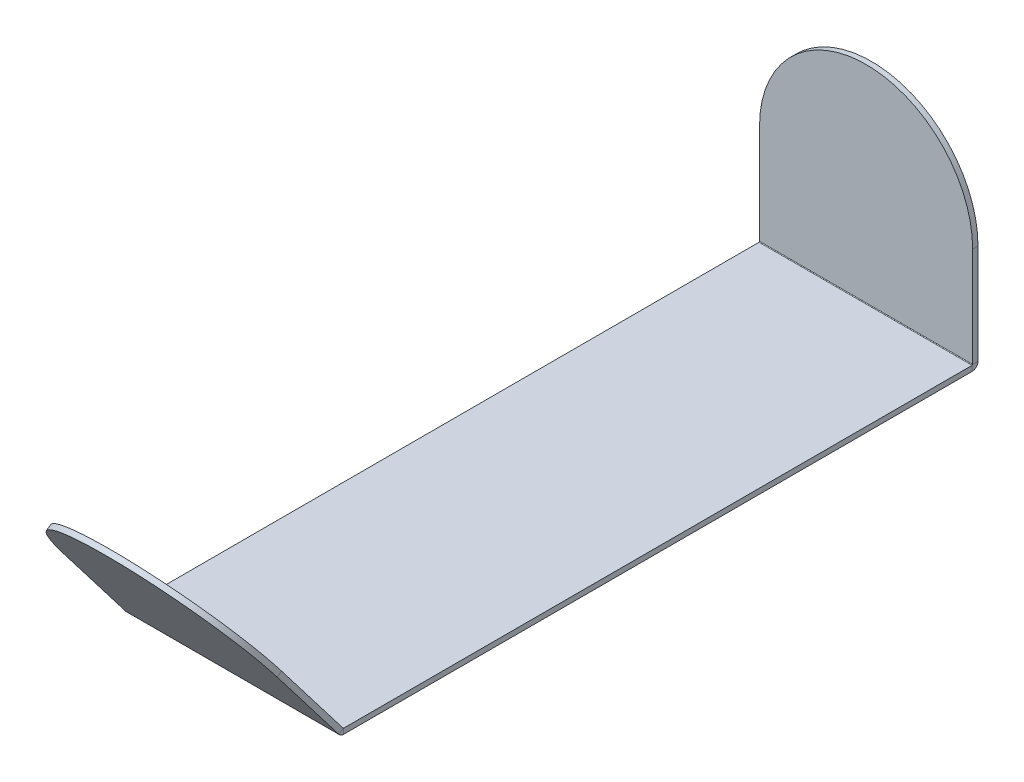
ISO-10303-21;
HEADER;
FILE_DESCRIPTION(('STEP AP214'),'2;1');
FILE_NAME('part.step','',(''),(''),'','','');
FILE_SCHEMA(('AUTOMOTIVE_DESIGN { 1 0 10303 214 1 1 1 1 }'));
ENDSEC;
DATA;
#1=APPLICATION_CONTEXT('core data for automotive mechanical design processes');
#2=APPLICATION_PROTOCOL_DEFINITION('international standard','automotive_design',2000,#1);
#3=PRODUCT_CONTEXT('',#1,'mechanical');
#4=PRODUCT('Part','Part','',(#3));
#5=PRODUCT_RELATED_PRODUCT_CATEGORY('part','',(#4));
#6=PRODUCT_DEFINITION_FORMATION('','',#4);
#7=PRODUCT_DEFINITION_CONTEXT('part definition',#1,'design');
#8=PRODUCT_DEFINITION('design','',#6,#7);
#9=PRODUCT_DEFINITION_SHAPE('','',#8);
#10=(LENGTH_UNIT() NAMED_UNIT(*) SI_UNIT(.MILLI.,.METRE.));
#11=(NAMED_UNIT(*) PLANE_ANGLE_UNIT() SI_UNIT($,.RADIAN.));
#12=(NAMED_UNIT(*) SI_UNIT($,.STERADIAN.) SOLID_ANGLE_UNIT());
#13=UNCERTAINTY_MEASURE_WITH_UNIT(LENGTH_MEASURE(1.E-05),#10,'distance_accuracy_value','');
#14=(GEOMETRIC_REPRESENTATION_CONTEXT(3) GLOBAL_UNCERTAINTY_ASSIGNED_CONTEXT((#13)) GLOBAL_UNIT_ASSIGNED_CONTEXT((#10,
#11,#12)) REPRESENTATION_CONTEXT('',''));
#15=CARTESIAN_POINT('',(0.,0.,0.));
#16=DIRECTION('',(0.,0.,1.));
#17=DIRECTION('',(1.,0.,0.));
#18=AXIS2_PLACEMENT_3D('',#15,#16,#17);
#19=CARTESIAN_POINT('',(-127.,-6.35,473.));
#20=DIRECTION('',(-1.,0.,0.));
#21=DIRECTION('',(0.,0.,1.));
#22=AXIS2_PLACEMENT_3D('',#19,#20,#21);
#23=PLANE('',#22);
#24=DIRECTION('',(0.,0.,1.));
#25=VECTOR('',#24,1.);
#26=CARTESIAN_POINT('',(-127.,-6.35,473.));
#27=LINE('',#26,#25);
#28=CARTESIAN_POINT('',(-127.,-6.35,-399.2634));
#29=VERTEX_POINT('',#28);
#30=CARTESIAN_POINT('',(-127.,-6.35,349.636749079185));
#31=VERTEX_POINT('',#30);
#32=EDGE_CURVE('E285',#29,#31,#27,.T.);
#33=ORIENTED_EDGE('',*,*,#32,.T.);
#34=DIRECTION('',(0.,1.,0.));
#35=VECTOR('',#34,1.);
#36=CARTESIAN_POINT('',(-127.,-6.35000000000001,349.636749079185));
#37=LINE('',#36,#35);
#38=CARTESIAN_POINT('',(-127.,0.,349.636749079185));
#39=VERTEX_POINT('',#38);
#40=EDGE_CURVE('E12',#31,#39,#37,.T.);
#41=ORIENTED_EDGE('',*,*,#40,.T.);
#42=DIRECTION('',(0.,0.,1.));
#43=VECTOR('',#42,1.);
#44=CARTESIAN_POINT('',(-127.,0.,473.));
#45=LINE('',#44,#43);
#46=CARTESIAN_POINT('',(-127.,0.,-399.2634));
#47=VERTEX_POINT('',#46);
#48=EDGE_CURVE('E297',#47,#39,#45,.T.);
#49=ORIENTED_EDGE('',*,*,#48,.F.);
#50=DIRECTION('',(0.,1.,0.));
#51=VECTOR('',#50,1.);
#52=CARTESIAN_POINT('',(-127.,-6.35000000000005,-399.2634));
#53=LINE('',#52,#51);
#54=EDGE_CURVE('E243',#29,#47,#53,.T.);
#55=ORIENTED_EDGE('',*,*,#54,.F.);
#56=EDGE_LOOP('',(#33,#41,#49,#55));
#57=FACE_BOUND('',#56,.T.);
#58=ADVANCED_FACE('F97',(#57),#23,.T.);
#59=CARTESIAN_POINT('',(0.,0.,473.));
#60=DIRECTION('',(0.,1.,0.));
#61=DIRECTION('',(0.,0.,1.));
#62=AXIS2_PLACEMENT_3D('',#59,#60,#61);
#63=PLANE('',#62);
#64=ORIENTED_EDGE('',*,*,#48,.T.);
#65=DIRECTION('',(1.,0.,0.));
#66=VECTOR('',#65,1.);
#67=CARTESIAN_POINT('',(0.,0.,349.636749079185));
#68=LINE('',#67,#66);
#69=CARTESIAN_POINT('',(127.,0.,349.636749079185));
#70=VERTEX_POINT('',#69);
#71=EDGE_CURVE('E105',#39,#70,#68,.T.);
#72=ORIENTED_EDGE('',*,*,#71,.T.);
#73=DIRECTION('',(0.,0.,-1.));
#74=VECTOR('',#73,1.);
#75=CARTESIAN_POINT('',(127.,0.,473.));
#76=LINE('',#75,#74);
#77=CARTESIAN_POINT('',(127.,0.,-399.2634));
#78=VERTEX_POINT('',#77);
#79=EDGE_CURVE('E296',#70,#78,#76,.T.);
#80=ORIENTED_EDGE('',*,*,#79,.T.);
#81=DIRECTION('',(1.,0.,0.));
#82=VECTOR('',#81,1.);
#83=CARTESIAN_POINT('',(0.,0.,-399.2634));
#84=LINE('',#83,#82);
#85=EDGE_CURVE('E254',#47,#78,#84,.T.);
#86=ORIENTED_EDGE('',*,*,#85,.F.);
#87=EDGE_LOOP('',(#64,#72,#80,#86));
#88=FACE_BOUND('',#87,.T.);
#89=ADVANCED_FACE('F350',(#88),#63,.T.);
#90=CARTESIAN_POINT('',(127.,-6.35,473.));
#91=DIRECTION('',(1.,0.,0.));
#92=DIRECTION('',(0.,0.,-1.));
#93=AXIS2_PLACEMENT_3D('',#90,#91,#92);
#94=PLANE('',#93);
#95=ORIENTED_EDGE('',*,*,#79,.F.);
#96=DIRECTION('',(0.,-1.,0.));
#97=VECTOR('',#96,1.);
#98=CARTESIAN_POINT('',(127.,-6.35000000000001,349.636749079185));
#99=LINE('',#98,#97);
#100=CARTESIAN_POINT('',(127.,-6.35,349.636749079185));
#101=VERTEX_POINT('',#100);
#102=EDGE_CURVE('E289',#70,#101,#99,.T.);
#103=ORIENTED_EDGE('',*,*,#102,.T.);
#104=DIRECTION('',(0.,0.,-1.));
#105=VECTOR('',#104,1.);
#106=CARTESIAN_POINT('',(127.,-6.35,473.));
#107=LINE('',#106,#105);
#108=CARTESIAN_POINT('',(127.,-6.35,-399.2634));
#109=VERTEX_POINT('',#108);
#110=EDGE_CURVE('E100',#101,#109,#107,.T.);
#111=ORIENTED_EDGE('',*,*,#110,.T.);
#112=DIRECTION('',(0.,-1.,0.));
#113=VECTOR('',#112,1.);
#114=CARTESIAN_POINT('',(127.,-6.35000000000005,-399.2634));
#115=LINE('',#114,#113);
#116=EDGE_CURVE('E251',#78,#109,#115,.T.);
#117=ORIENTED_EDGE('',*,*,#116,.F.);
#118=EDGE_LOOP('',(#95,#103,#111,#117));
#119=FACE_BOUND('',#118,.T.);
#120=ADVANCED_FACE('F305',(#119),#94,.T.);
#121=CARTESIAN_POINT('',(-127.,-876.27468897737,-406.350000000003));
#122=DIRECTION('',(-1.,0.,0.));
#123=DIRECTION('',(0.,-1.,0.));
#124=AXIS2_PLACEMENT_3D('',#121,#122,#123);
#125=PLANE('',#124);
#126=DIRECTION('',(0.,-1.,0.));
#127=VECTOR('',#126,1.);
#128=CARTESIAN_POINT('',(-127.,-876.27468897737,-406.350000000003));
#129=LINE('',#128,#127);
#130=CARTESIAN_POINT('',(-127.,119.72531102263,-406.35));
#131=VERTEX_POINT('',#130);
#132=CARTESIAN_POINT('',(-127.,0.736600000000032,-406.35));
#133=VERTEX_POINT('',#132);
#134=EDGE_CURVE('E262',#131,#133,#129,.T.);
#135=ORIENTED_EDGE('',*,*,#134,.T.);
#136=DIRECTION('',(0.,0.,1.));
#137=VECTOR('',#136,1.);
#138=CARTESIAN_POINT('',(-127.,0.736600000000032,-406.35));
#139=LINE('',#138,#137);
#140=CARTESIAN_POINT('',(-127.,0.736600000000032,-400.));
#141=VERTEX_POINT('',#140);
#142=EDGE_CURVE('E279',#133,#141,#139,.T.);
#143=ORIENTED_EDGE('',*,*,#142,.T.);
#144=DIRECTION('',(0.,-1.,0.));
#145=VECTOR('',#144,1.);
#146=CARTESIAN_POINT('',(-127.,-876.27468897737,-400.000000000003));
#147=LINE('',#146,#145);
#148=CARTESIAN_POINT('',(-127.,119.72531102263,-400.));
#149=VERTEX_POINT('',#148);
#150=EDGE_CURVE('E121',#149,#141,#147,.T.);
#151=ORIENTED_EDGE('',*,*,#150,.F.);
#152=DIRECTION('',(0.,0.,1.));
#153=VECTOR('',#152,1.);
#154=CARTESIAN_POINT('',(-127.,119.72531102263,-406.35));
#155=LINE('',#154,#153);
#156=EDGE_CURVE('E267',#131,#149,#155,.T.);
#157=ORIENTED_EDGE('',*,*,#156,.F.);
#158=EDGE_LOOP('',(#135,#143,#151,#157));
#159=FACE_BOUND('',#158,.T.);
#160=ADVANCED_FACE('F326',(#159),#125,.T.);
#161=CARTESIAN_POINT('',(127.,-876.27468897737,-406.350000000003));
#162=DIRECTION('',(1.,0.,0.));
#163=DIRECTION('',(0.,1.,0.));
#164=AXIS2_PLACEMENT_3D('',#161,#162,#163);
#165=PLANE('',#164);
#166=DIRECTION('',(0.,1.,0.));
#167=VECTOR('',#166,1.);
#168=CARTESIAN_POINT('',(127.,-876.27468897737,-400.000000000003));
#169=LINE('',#168,#167);
#170=CARTESIAN_POINT('',(127.,0.736600000000032,-400.));
#171=VERTEX_POINT('',#170);
#172=CARTESIAN_POINT('',(127.,119.72531102263,-400.));
#173=VERTEX_POINT('',#172);
#174=EDGE_CURVE('E266',#171,#173,#169,.T.);
#175=ORIENTED_EDGE('',*,*,#174,.F.);
#176=DIRECTION('',(0.,0.,-1.));
#177=VECTOR('',#176,1.);
#178=CARTESIAN_POINT('',(127.,0.736600000000032,-406.35));
#179=LINE('',#178,#177);
#180=CARTESIAN_POINT('',(127.,0.736599999999916,-406.35));
#181=VERTEX_POINT('',#180);
#182=EDGE_CURVE('E275',#171,#181,#179,.T.);
#183=ORIENTED_EDGE('',*,*,#182,.T.);
#184=DIRECTION('',(0.,1.,0.));
#185=VECTOR('',#184,1.);
#186=CARTESIAN_POINT('',(127.,-876.27468897737,-406.350000000003));
#187=LINE('',#186,#185);
#188=CARTESIAN_POINT('',(127.,119.72531102263,-406.35));
#189=VERTEX_POINT('',#188);
#190=EDGE_CURVE('E263',#181,#189,#187,.T.);
#191=ORIENTED_EDGE('',*,*,#190,.T.);
#192=DIRECTION('',(0.,0.,1.));
#193=VECTOR('',#192,1.);
#194=CARTESIAN_POINT('',(127.,119.72531102263,-406.35));
#195=LINE('',#194,#193);
#196=EDGE_CURVE('E270',#189,#173,#195,.T.);
#197=ORIENTED_EDGE('',*,*,#196,.T.);
#198=EDGE_LOOP('',(#175,#183,#191,#197));
#199=FACE_BOUND('',#198,.T.);
#200=ADVANCED_FACE('F335',(#199),#165,.T.);
#201=CARTESIAN_POINT('',(0.,-876.27468897737,-400.000000000003));
#202=DIRECTION('',(0.,0.,1.));
#203=DIRECTION('',(0.,-1.,0.));
#204=AXIS2_PLACEMENT_3D('',#201,#202,#203);
#205=PLANE('',#204);
#206=ORIENTED_EDGE('',*,*,#150,.T.);
#207=DIRECTION('',(1.,0.,0.));
#208=VECTOR('',#207,1.);
#209=CARTESIAN_POINT('',(0.,0.736600000000032,-400.));
#210=LINE('',#209,#208);
#211=EDGE_CURVE('E277',#141,#171,#210,.T.);
#212=ORIENTED_EDGE('',*,*,#211,.T.);
#213=ORIENTED_EDGE('',*,*,#174,.T.);
#214=CARTESIAN_POINT('',(0.,119.72531102263,-400.));
#215=DIRECTION('',(0.,0.,1.));
#216=DIRECTION('',(0.,-1.,0.));
#217=AXIS2_PLACEMENT_3D('',#214,#215,#216);
#218=CIRCLE('',#217,127.);
#219=EDGE_CURVE('E264',#173,#149,#218,.T.);
#220=ORIENTED_EDGE('',*,*,#219,.T.);
#221=EDGE_LOOP('',(#206,#212,#213,#220));
#222=FACE_BOUND('',#221,.T.);
#223=ADVANCED_FACE('F333',(#222),#205,.T.);
#224=CARTESIAN_POINT('',(0.,119.72531102263,-406.35));
#225=DIRECTION('',(0.,0.,1.));
#226=DIRECTION('',(0.,-1.,0.));
#227=AXIS2_PLACEMENT_3D('',#224,#225,#226);
#228=CYLINDRICAL_SURFACE('',#227,127.);
#229=ORIENTED_EDGE('',*,*,#219,.F.);
#230=ORIENTED_EDGE('',*,*,#196,.F.);
#231=CARTESIAN_POINT('',(0.,119.72531102263,-406.35));
#232=DIRECTION('',(0.,0.,1.));
#233=DIRECTION('',(0.,-1.,0.));
#234=AXIS2_PLACEMENT_3D('',#231,#232,#233);
#235=CIRCLE('',#234,127.);
#236=EDGE_CURVE('E259',#189,#131,#235,.T.);
#237=ORIENTED_EDGE('',*,*,#236,.T.);
#238=ORIENTED_EDGE('',*,*,#156,.T.);
#239=EDGE_LOOP('',(#229,#230,#237,#238));
#240=FACE_BOUND('',#239,.T.);
#241=ADVANCED_FACE('F339',(#240),#228,.T.);
#242=CARTESIAN_POINT('',(0.,-876.27468897737,-406.350000000003));
#243=DIRECTION('',(0.,0.,1.));
#244=DIRECTION('',(0.,-1.,0.));
#245=AXIS2_PLACEMENT_3D('',#242,#243,#244);
#246=PLANE('',#245);
#247=DIRECTION('',(1.,0.,0.));
#248=VECTOR('',#247,1.);
#249=CARTESIAN_POINT('',(0.,0.736600000000032,-406.35));
#250=LINE('',#249,#248);
#251=EDGE_CURVE('E269',#133,#181,#250,.T.);
#252=ORIENTED_EDGE('',*,*,#251,.F.);
#253=ORIENTED_EDGE('',*,*,#134,.F.);
#254=ORIENTED_EDGE('',*,*,#236,.F.);
#255=ORIENTED_EDGE('',*,*,#190,.F.);
#256=EDGE_LOOP('',(#252,#253,#254,#255));
#257=FACE_BOUND('',#256,.T.);
#258=ADVANCED_FACE('F322',(#257),#246,.F.);
#259=CARTESIAN_POINT('',(0.,-6.35,473.));
#260=DIRECTION('',(0.,1.,0.));
#261=DIRECTION('',(0.,0.,1.));
#262=AXIS2_PLACEMENT_3D('',#259,#260,#261);
#263=PLANE('',#262);
#264=DIRECTION('',(1.,0.,0.));
#265=VECTOR('',#264,1.);
#266=CARTESIAN_POINT('',(0.,-6.35,349.636749079185));
#267=LINE('',#266,#265);
#268=EDGE_CURVE('E281',#31,#101,#267,.T.);
#269=ORIENTED_EDGE('',*,*,#268,.F.);
#270=ORIENTED_EDGE('',*,*,#32,.F.);
#271=DIRECTION('',(1.,0.,0.));
#272=VECTOR('',#271,1.);
#273=CARTESIAN_POINT('',(0.,-6.35,-399.2634));
#274=LINE('',#273,#272);
#275=EDGE_CURVE('E248',#29,#109,#274,.T.);
#276=ORIENTED_EDGE('',*,*,#275,.T.);
#277=ORIENTED_EDGE('',*,*,#110,.F.);
#278=EDGE_LOOP('',(#269,#270,#276,#277));
#279=FACE_BOUND('',#278,.T.);
#280=ADVANCED_FACE('F309',(#279),#263,.F.);
#281=CARTESIAN_POINT('',(-127.,0.7366,-399.2634));
#282=DIRECTION('',(-1.,0.,0.));
#283=DIRECTION('',(0.,0.,1.));
#284=AXIS2_PLACEMENT_3D('',#281,#282,#283);
#285=PLANE('',#284);
#286=ORIENTED_EDGE('',*,*,#54,.T.);
#287=CARTESIAN_POINT('',(-127.,0.7366,-399.2634));
#288=DIRECTION('',(1.,0.,0.));
#289=DIRECTION('',(0.,0.,-1.));
#290=AXIS2_PLACEMENT_3D('',#287,#288,#289);
#291=CIRCLE('',#290,0.7366);
#292=EDGE_CURVE('E232',#47,#141,#291,.T.);
#293=ORIENTED_EDGE('',*,*,#292,.T.);
#294=ORIENTED_EDGE('',*,*,#142,.F.);
#295=CARTESIAN_POINT('',(-127.,0.7366,-399.2634));
#296=DIRECTION('',(1.,0.,0.));
#297=DIRECTION('',(0.,0.,1.));
#298=AXIS2_PLACEMENT_3D('',#295,#296,#297);
#299=CIRCLE('',#298,7.0866);
#300=EDGE_CURVE('E236',#29,#133,#299,.T.);
#301=ORIENTED_EDGE('',*,*,#300,.F.);
#302=EDGE_LOOP('',(#286,#293,#294,#301));
#303=FACE_BOUND('',#302,.T.);
#304=ADVANCED_FACE('F329',(#303),#285,.T.);
#305=CARTESIAN_POINT('',(127.,0.7366,-399.2634));
#306=DIRECTION('',(1.,0.,0.));
#307=DIRECTION('',(0.,0.,-1.));
#308=AXIS2_PLACEMENT_3D('',#305,#306,#307);
#309=PLANE('',#308);
#310=ORIENTED_EDGE('',*,*,#182,.F.);
#311=CARTESIAN_POINT('',(127.,0.7366,-399.2634));
#312=DIRECTION('',(1.,0.,0.));
#313=DIRECTION('',(0.,0.,-1.));
#314=AXIS2_PLACEMENT_3D('',#311,#312,#313);
#315=CIRCLE('',#314,0.7366);
#316=EDGE_CURVE('E240',#171,#78,#315,.F.);
#317=ORIENTED_EDGE('',*,*,#316,.T.);
#318=ORIENTED_EDGE('',*,*,#116,.T.);
#319=CARTESIAN_POINT('',(127.,0.7366,-399.2634));
#320=DIRECTION('',(-1.,0.,0.));
#321=DIRECTION('',(0.,0.,-1.));
#322=AXIS2_PLACEMENT_3D('',#319,#320,#321);
#323=CIRCLE('',#322,7.0866);
#324=EDGE_CURVE('E239',#181,#109,#323,.T.);
#325=ORIENTED_EDGE('',*,*,#324,.F.);
#326=EDGE_LOOP('',(#310,#317,#318,#325));
#327=FACE_BOUND('',#326,.T.);
#328=ADVANCED_FACE('F315',(#327),#309,.T.);
#329=CARTESIAN_POINT('',(-254.12371977,0.7366,-399.2634));
#330=DIRECTION('',(1.,0.,0.));
#331=DIRECTION('',(0.,0.,-1.));
#332=AXIS2_PLACEMENT_3D('',#329,#330,#331);
#333=CYLINDRICAL_SURFACE('',#332,7.0866);
#334=ORIENTED_EDGE('',*,*,#324,.T.);
#335=ORIENTED_EDGE('',*,*,#275,.F.);
#336=ORIENTED_EDGE('',*,*,#300,.T.);
#337=ORIENTED_EDGE('',*,*,#251,.T.);
#338=EDGE_LOOP('',(#334,#335,#336,#337));
#339=FACE_BOUND('',#338,.T.);
#340=ADVANCED_FACE('F317',(#339),#333,.T.);
#341=CARTESIAN_POINT('',(-254.12371977,0.7366,-399.2634));
#342=DIRECTION('',(1.,0.,0.));
#343=DIRECTION('',(0.,0.,-1.));
#344=AXIS2_PLACEMENT_3D('',#341,#342,#343);
#345=CYLINDRICAL_SURFACE('',#344,0.7366);
#346=ORIENTED_EDGE('',*,*,#316,.F.);
#347=ORIENTED_EDGE('',*,*,#211,.F.);
#348=ORIENTED_EDGE('',*,*,#292,.F.);
#349=ORIENTED_EDGE('',*,*,#85,.T.);
#350=EDGE_LOOP('',(#346,#347,#348,#349));
#351=FACE_BOUND('',#350,.T.);
#352=ADVANCED_FACE('F332',(#351),#345,.F.);
#353=CARTESIAN_POINT('',(-127.,0.7366,349.636749079185));
#354=DIRECTION('',(-1.,0.,0.));
#355=DIRECTION('',(0.,0.,1.));
#356=AXIS2_PLACEMENT_3D('',#353,#354,#355);
#357=PLANE('',#356);
#358=DIRECTION('',(0.,0.608761429008719,-0.793353340291236));
#359=VECTOR('',#358,1.);
#360=CARTESIAN_POINT('',(-127.,-3.57744874281318,355.258926860493));
#361=LINE('',#360,#359);
#362=CARTESIAN_POINT('',(-127.,-3.57744874281321,355.258926860493));
#363=VERTEX_POINT('',#362);
#364=CARTESIAN_POINT('',(-127.,0.28818633139216,350.221133149644));
#365=VERTEX_POINT('',#364);
#366=EDGE_CURVE('E195',#363,#365,#361,.T.);
#367=ORIENTED_EDGE('',*,*,#366,.T.);
#368=CARTESIAN_POINT('',(-127.,0.7366,349.636749079185));
#369=DIRECTION('',(-1.,0.,0.));
#370=DIRECTION('',(0.,0.,1.));
#371=AXIS2_PLACEMENT_3D('',#368,#369,#370);
#372=CIRCLE('',#371,0.7366);
#373=EDGE_CURVE('E113',#365,#39,#372,.F.);
#374=ORIENTED_EDGE('',*,*,#373,.T.);
#375=ORIENTED_EDGE('',*,*,#40,.F.);
#376=CARTESIAN_POINT('',(-127.,0.7366,349.636749079185));
#377=DIRECTION('',(1.,0.,0.));
#378=DIRECTION('',(0.,0.,1.));
#379=AXIS2_PLACEMENT_3D('',#376,#377,#378);
#380=CIRCLE('',#379,7.0866);
#381=EDGE_CURVE('E225',#363,#31,#380,.T.);
#382=ORIENTED_EDGE('',*,*,#381,.F.);
#383=EDGE_LOOP('',(#367,#374,#375,#382));
#384=FACE_BOUND('',#383,.T.);
#385=ADVANCED_FACE('F366',(#384),#357,.T.);
#386=CARTESIAN_POINT('',(127.,0.7366,349.636749079185));
#387=DIRECTION('',(1.,0.,0.));
#388=DIRECTION('',(0.,0.,-1.));
#389=AXIS2_PLACEMENT_3D('',#386,#387,#388);
#390=PLANE('',#389);
#391=CARTESIAN_POINT('',(127.,0.7366,349.636749079185));
#392=DIRECTION('',(-1.,0.,0.));
#393=DIRECTION('',(0.,0.,1.));
#394=AXIS2_PLACEMENT_3D('',#391,#392,#393);
#395=CIRCLE('',#394,0.7366);
#396=CARTESIAN_POINT('',(127.,0.28818633139216,350.221133149644));
#397=VERTEX_POINT('',#396);
#398=EDGE_CURVE('E229',#70,#397,#395,.T.);
#399=ORIENTED_EDGE('',*,*,#398,.T.);
#400=DIRECTION('',(0.,-0.608761429008719,0.793353340291236));
#401=VECTOR('',#400,1.);
#402=CARTESIAN_POINT('',(127.,-3.57744874281318,355.258926860493));
#403=LINE('',#402,#401);
#404=CARTESIAN_POINT('',(127.,-3.57744874281318,355.258926860493));
#405=VERTEX_POINT('',#404);
#406=EDGE_CURVE('E213',#397,#405,#403,.T.);
#407=ORIENTED_EDGE('',*,*,#406,.T.);
#408=CARTESIAN_POINT('',(127.,0.7366,349.636749079185));
#409=DIRECTION('',(-1.,0.,0.));
#410=DIRECTION('',(0.,0.,-1.));
#411=AXIS2_PLACEMENT_3D('',#408,#409,#410);
#412=CIRCLE('',#411,7.0866);
#413=EDGE_CURVE('E228',#101,#405,#412,.T.);
#414=ORIENTED_EDGE('',*,*,#413,.F.);
#415=ORIENTED_EDGE('',*,*,#102,.F.);
#416=EDGE_LOOP('',(#399,#407,#414,#415));
#417=FACE_BOUND('',#416,.T.);
#418=ADVANCED_FACE('F360',(#417),#390,.T.);
#419=CARTESIAN_POINT('',(254.094457229401,0.7366,349.636749079185));
#420=DIRECTION('',(-1.,0.,0.));
#421=DIRECTION('',(0.,0.,1.));
#422=AXIS2_PLACEMENT_3D('',#419,#420,#421);
#423=CYLINDRICAL_SURFACE('',#422,7.0866);
#424=ORIENTED_EDGE('',*,*,#268,.T.);
#425=ORIENTED_EDGE('',*,*,#413,.T.);
#426=DIRECTION('',(1.,0.,0.));
#427=VECTOR('',#426,1.);
#428=CARTESIAN_POINT('',(0.,-3.57744874281318,355.258926860493));
#429=LINE('',#428,#427);
#430=EDGE_CURVE('E215',#363,#405,#429,.T.);
#431=ORIENTED_EDGE('',*,*,#430,.F.);
#432=ORIENTED_EDGE('',*,*,#381,.T.);
#433=EDGE_LOOP('',(#424,#425,#431,#432));
#434=FACE_BOUND('',#433,.T.);
#435=ADVANCED_FACE('F364',(#434),#423,.T.);
#436=CARTESIAN_POINT('',(254.094457229401,0.7366,349.636749079185));
#437=DIRECTION('',(-1.,0.,0.));
#438=DIRECTION('',(0.,0.,1.));
#439=AXIS2_PLACEMENT_3D('',#436,#437,#438);
#440=CYLINDRICAL_SURFACE('',#439,0.7366);
#441=ORIENTED_EDGE('',*,*,#71,.F.);
#442=ORIENTED_EDGE('',*,*,#373,.F.);
#443=DIRECTION('',(1.,0.,0.));
#444=VECTOR('',#443,1.);
#445=CARTESIAN_POINT('',(0.,0.28818633139216,350.221133149644));
#446=LINE('',#445,#444);
#447=EDGE_CURVE('E218',#365,#397,#446,.T.);
#448=ORIENTED_EDGE('',*,*,#447,.T.);
#449=ORIENTED_EDGE('',*,*,#398,.F.);
#450=EDGE_LOOP('',(#441,#442,#448,#449));
#451=FACE_BOUND('',#450,.T.);
#452=ADVANCED_FACE('F357',(#451),#440,.F.);
#453=CARTESIAN_POINT('',(0.,92.0959255230094,428.67168896567));
#454=DIRECTION('',(0.,0.608761429008719,-0.793353340291236));
#455=DIRECTION('',(0.,0.793353340291236,0.608761429008719));
#456=AXIS2_PLACEMENT_3D('',#453,#454,#455);
#457=CYLINDRICAL_SURFACE('',#456,127.);
#458=CARTESIAN_POINT('',(0.,95.9615605972147,423.633895254821));
#459=DIRECTION('',(0.,0.608761429008719,-0.793353340291236));
#460=DIRECTION('',(0.,0.793353340291236,0.608761429008719));
#461=AXIS2_PLACEMENT_3D('',#458,#459,#460);
#462=CIRCLE('',#461,127.);
#463=CARTESIAN_POINT('',(-127.,95.9615605972147,423.633895254821));
#464=VERTEX_POINT('',#463);
#465=CARTESIAN_POINT('',(127.,95.9615605972147,423.633895254821));
#466=VERTEX_POINT('',#465);
#467=EDGE_CURVE('E206',#464,#466,#462,.T.);
#468=ORIENTED_EDGE('',*,*,#467,.F.);
#469=DIRECTION('',(0.,0.608761429008719,-0.793353340291236));
#470=VECTOR('',#469,1.);
#471=CARTESIAN_POINT('',(-127.,92.0959255230094,428.67168896567));
#472=LINE('',#471,#470);
#473=CARTESIAN_POINT('',(-127.,92.0959255230094,428.67168896567));
#474=VERTEX_POINT('',#473);
#475=EDGE_CURVE('E193',#474,#464,#472,.T.);
#476=ORIENTED_EDGE('',*,*,#475,.F.);
#477=CARTESIAN_POINT('',(0.,92.0959255230094,428.67168896567));
#478=DIRECTION('',(0.,0.608761429008719,-0.793353340291236));
#479=DIRECTION('',(0.,0.793353340291236,0.608761429008719));
#480=AXIS2_PLACEMENT_3D('',#477,#478,#479);
#481=CIRCLE('',#480,127.);
#482=CARTESIAN_POINT('',(127.,92.0959255230094,428.67168896567));
#483=VERTEX_POINT('',#482);
#484=EDGE_CURVE('E204',#474,#483,#481,.T.);
#485=ORIENTED_EDGE('',*,*,#484,.T.);
#486=DIRECTION('',(0.,0.608761429008719,-0.793353340291236));
#487=VECTOR('',#486,1.);
#488=CARTESIAN_POINT('',(127.,92.0959255230094,428.67168896567));
#489=LINE('',#488,#487);
#490=EDGE_CURVE('E212',#483,#466,#489,.T.);
#491=ORIENTED_EDGE('',*,*,#490,.T.);
#492=EDGE_LOOP('',(#468,#476,#485,#491));
#493=FACE_BOUND('',#492,.T.);
#494=ADVANCED_FACE('F203',(#493),#457,.T.);
#495=CARTESIAN_POINT('',(0.,92.0959255230094,428.67168896567));
#496=DIRECTION('',(0.,0.608761429008719,-0.793353340291236));
#497=DIRECTION('',(0.,0.793353340291236,0.608761429008719));
#498=AXIS2_PLACEMENT_3D('',#495,#496,#497);
#499=PLANE('',#498);
#500=DIRECTION('',(0.,0.793353340291236,0.608761429008719));
#501=VECTOR('',#500,1.);
#502=CARTESIAN_POINT('',(-127.,92.0959255230094,428.67168896567));
#503=LINE('',#502,#501);
#504=EDGE_CURVE('E190',#363,#474,#503,.T.);
#505=ORIENTED_EDGE('',*,*,#504,.F.);
#506=ORIENTED_EDGE('',*,*,#430,.T.);
#507=DIRECTION('',(0.,-0.793353340291236,-0.608761429008719));
#508=VECTOR('',#507,1.);
#509=CARTESIAN_POINT('',(127.,92.0959255230094,428.67168896567));
#510=LINE('',#509,#508);
#511=EDGE_CURVE('E211',#483,#405,#510,.T.);
#512=ORIENTED_EDGE('',*,*,#511,.F.);
#513=ORIENTED_EDGE('',*,*,#484,.F.);
#514=EDGE_LOOP('',(#505,#506,#512,#513));
#515=FACE_BOUND('',#514,.T.);
#516=ADVANCED_FACE('F209',(#515),#499,.F.);
#517=CARTESIAN_POINT('',(127.,92.0959255230094,428.67168896567));
#518=DIRECTION('',(1.,0.,0.));
#519=DIRECTION('',(0.,-0.793353340291236,-0.608761429008719));
#520=AXIS2_PLACEMENT_3D('',#517,#518,#519);
#521=PLANE('',#520);
#522=ORIENTED_EDGE('',*,*,#406,.F.);
#523=DIRECTION('',(0.,-0.793353340291236,-0.608761429008719));
#524=VECTOR('',#523,1.);
#525=CARTESIAN_POINT('',(127.,95.9615605972147,423.633895254821));
#526=LINE('',#525,#524);
#527=EDGE_CURVE('E199',#466,#397,#526,.T.);
#528=ORIENTED_EDGE('',*,*,#527,.F.);
#529=ORIENTED_EDGE('',*,*,#490,.F.);
#530=ORIENTED_EDGE('',*,*,#511,.T.);
#531=EDGE_LOOP('',(#522,#528,#529,#530));
#532=FACE_BOUND('',#531,.T.);
#533=ADVANCED_FACE('F510',(#532),#521,.T.);
#534=CARTESIAN_POINT('',(0.,95.9615605972147,423.633895254821));
#535=DIRECTION('',(0.,0.608761429008719,-0.793353340291236));
#536=DIRECTION('',(0.,0.793353340291236,0.608761429008719));
#537=AXIS2_PLACEMENT_3D('',#534,#535,#536);
#538=PLANE('',#537);
#539=ORIENTED_EDGE('',*,*,#447,.F.);
#540=DIRECTION('',(0.,0.793353340291236,0.608761429008719));
#541=VECTOR('',#540,1.);
#542=CARTESIAN_POINT('',(-127.,95.9615605972147,423.633895254821));
#543=LINE('',#542,#541);
#544=EDGE_CURVE('E545',#365,#464,#543,.T.);
#545=ORIENTED_EDGE('',*,*,#544,.T.);
#546=ORIENTED_EDGE('',*,*,#467,.T.);
#547=ORIENTED_EDGE('',*,*,#527,.T.);
#548=EDGE_LOOP('',(#539,#545,#546,#547));
#549=FACE_BOUND('',#548,.T.);
#550=ADVANCED_FACE('F519',(#549),#538,.T.);
#551=CARTESIAN_POINT('',(-127.,92.0959255230094,428.67168896567));
#552=DIRECTION('',(-1.,0.,0.));
#553=DIRECTION('',(0.,0.793353340291236,0.608761429008719));
#554=AXIS2_PLACEMENT_3D('',#551,#552,#553);
#555=PLANE('',#554);
#556=ORIENTED_EDGE('',*,*,#366,.F.);
#557=ORIENTED_EDGE('',*,*,#504,.T.);
#558=ORIENTED_EDGE('',*,*,#475,.T.);
#559=ORIENTED_EDGE('',*,*,#544,.F.);
#560=EDGE_LOOP('',(#556,#557,#558,#559));
#561=FACE_BOUND('',#560,.T.);
#562=ADVANCED_FACE('F192',(#561),#555,.T.);
#563=CLOSED_SHELL('',(#58,#89,#120,#160,#200,#223,#241,#258,#280,#304,#328,#340,#352,#385,#418,
#435,#452,#494,#516,#533,#550,#562));
#564=MANIFOLD_SOLID_BREP('B2',#563);
#565=ADVANCED_BREP_SHAPE_REPRESENTATION('',(#18,#564),#14);
#566=SHAPE_DEFINITION_REPRESENTATION(#9,#565);
ENDSEC;
END-ISO-10303-21;
